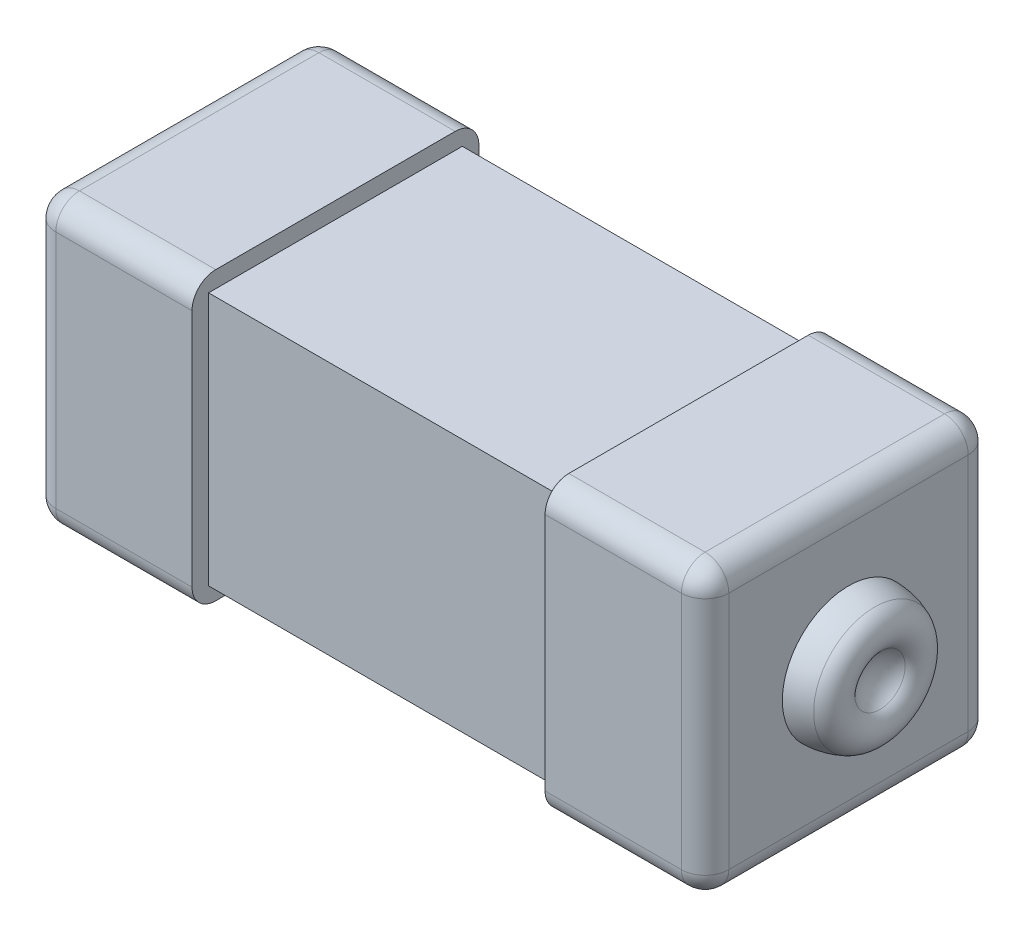
ISO-10303-21;
HEADER;
FILE_DESCRIPTION(('STEP AP214'),'2;1');
FILE_NAME('part.step','',(''),(''),'','','');
FILE_SCHEMA(('AUTOMOTIVE_DESIGN { 1 0 10303 214 1 1 1 1 }'));
ENDSEC;
DATA;
#1=APPLICATION_CONTEXT('core data for automotive mechanical design processes');
#2=APPLICATION_PROTOCOL_DEFINITION('international standard','automotive_design',2000,#1);
#3=PRODUCT_CONTEXT('',#1,'mechanical');
#4=PRODUCT('Part','Part','',(#3));
#5=PRODUCT_RELATED_PRODUCT_CATEGORY('part','',(#4));
#6=PRODUCT_DEFINITION_FORMATION('','',#4);
#7=PRODUCT_DEFINITION_CONTEXT('part definition',#1,'design');
#8=PRODUCT_DEFINITION('design','',#6,#7);
#9=PRODUCT_DEFINITION_SHAPE('','',#8);
#10=(LENGTH_UNIT() NAMED_UNIT(*) SI_UNIT(.MILLI.,.METRE.));
#11=(NAMED_UNIT(*) PLANE_ANGLE_UNIT() SI_UNIT($,.RADIAN.));
#12=(NAMED_UNIT(*) SI_UNIT($,.STERADIAN.) SOLID_ANGLE_UNIT());
#13=UNCERTAINTY_MEASURE_WITH_UNIT(LENGTH_MEASURE(1.E-05),#10,'distance_accuracy_value','');
#14=(GEOMETRIC_REPRESENTATION_CONTEXT(3) GLOBAL_UNCERTAINTY_ASSIGNED_CONTEXT((#13)) GLOBAL_UNIT_ASSIGNED_CONTEXT((#10,
#11,#12)) REPRESENTATION_CONTEXT('',''));
#15=CARTESIAN_POINT('',(0.,0.,0.));
#16=DIRECTION('',(0.,0.,1.));
#17=DIRECTION('',(1.,0.,0.));
#18=AXIS2_PLACEMENT_3D('',#15,#16,#17);
#19=CARTESIAN_POINT('',(1.6,1.15,1.15));
#20=DIRECTION('',(0.,0.,-1.));
#21=DIRECTION('',(0.,1.,0.));
#22=AXIS2_PLACEMENT_3D('',#19,#20,#21);
#23=PLANE('',#22);
#24=DIRECTION('',(0.,-1.,0.));
#25=VECTOR('',#24,1.);
#26=CARTESIAN_POINT('',(-1.6,1.15,1.15));
#27=LINE('',#26,#25);
#28=CARTESIAN_POINT('',(-1.6,1.15,1.15));
#29=VERTEX_POINT('',#28);
#30=CARTESIAN_POINT('',(-1.6,-1.15,1.15));
#31=VERTEX_POINT('',#30);
#32=EDGE_CURVE('E203',#29,#31,#27,.T.);
#33=ORIENTED_EDGE('',*,*,#32,.T.);
#34=DIRECTION('',(-1.,0.,0.));
#35=VECTOR('',#34,1.);
#36=CARTESIAN_POINT('',(1.6,-1.15,1.15));
#37=LINE('',#36,#35);
#38=CARTESIAN_POINT('',(1.6,-1.15,1.15));
#39=VERTEX_POINT('',#38);
#40=EDGE_CURVE('E225',#39,#31,#37,.T.);
#41=ORIENTED_EDGE('',*,*,#40,.F.);
#42=DIRECTION('',(0.,-1.,0.));
#43=VECTOR('',#42,1.);
#44=CARTESIAN_POINT('',(1.6,1.15,1.15));
#45=LINE('',#44,#43);
#46=CARTESIAN_POINT('',(1.6,1.15,1.15));
#47=VERTEX_POINT('',#46);
#48=EDGE_CURVE('E208',#47,#39,#45,.T.);
#49=ORIENTED_EDGE('',*,*,#48,.F.);
#50=DIRECTION('',(-1.,0.,0.));
#51=VECTOR('',#50,1.);
#52=CARTESIAN_POINT('',(1.6,1.15,1.15));
#53=LINE('',#52,#51);
#54=EDGE_CURVE('E223',#47,#29,#53,.T.);
#55=ORIENTED_EDGE('',*,*,#54,.T.);
#56=EDGE_LOOP('',(#33,#41,#49,#55));
#57=FACE_BOUND('',#56,.T.);
#58=ADVANCED_FACE('F37',(#57),#23,.F.);
#59=CARTESIAN_POINT('',(1.6,-1.15,1.15));
#60=DIRECTION('',(0.,1.,0.));
#61=DIRECTION('',(0.,0.,1.));
#62=AXIS2_PLACEMENT_3D('',#59,#60,#61);
#63=PLANE('',#62);
#64=DIRECTION('',(0.,0.,-1.));
#65=VECTOR('',#64,1.);
#66=CARTESIAN_POINT('',(-1.6,-1.15,1.15));
#67=LINE('',#66,#65);
#68=CARTESIAN_POINT('',(-1.6,-1.15,-1.15));
#69=VERTEX_POINT('',#68);
#70=EDGE_CURVE('E217',#31,#69,#67,.T.);
#71=ORIENTED_EDGE('',*,*,#70,.T.);
#72=DIRECTION('',(-1.,0.,0.));
#73=VECTOR('',#72,1.);
#74=CARTESIAN_POINT('',(1.6,-1.15,-1.15));
#75=LINE('',#74,#73);
#76=CARTESIAN_POINT('',(1.6,-1.15,-1.15));
#77=VERTEX_POINT('',#76);
#78=EDGE_CURVE('E216',#77,#69,#75,.T.);
#79=ORIENTED_EDGE('',*,*,#78,.F.);
#80=DIRECTION('',(0.,0.,-1.));
#81=VECTOR('',#80,1.);
#82=CARTESIAN_POINT('',(1.6,-1.15,1.15));
#83=LINE('',#82,#81);
#84=EDGE_CURVE('E430',#39,#77,#83,.T.);
#85=ORIENTED_EDGE('',*,*,#84,.F.);
#86=ORIENTED_EDGE('',*,*,#40,.T.);
#87=EDGE_LOOP('',(#71,#79,#85,#86));
#88=FACE_BOUND('',#87,.T.);
#89=ADVANCED_FACE('F438',(#88),#63,.F.);
#90=CARTESIAN_POINT('',(1.6,1.15,-1.15));
#91=DIRECTION('',(0.,0.,1.));
#92=DIRECTION('',(0.,-1.,0.));
#93=AXIS2_PLACEMENT_3D('',#90,#91,#92);
#94=PLANE('',#93);
#95=DIRECTION('',(0.,1.,0.));
#96=VECTOR('',#95,1.);
#97=CARTESIAN_POINT('',(-1.6,1.15,-1.15));
#98=LINE('',#97,#96);
#99=CARTESIAN_POINT('',(-1.6,1.15,-1.15));
#100=VERTEX_POINT('',#99);
#101=EDGE_CURVE('E200',#69,#100,#98,.T.);
#102=ORIENTED_EDGE('',*,*,#101,.T.);
#103=DIRECTION('',(-1.,0.,0.));
#104=VECTOR('',#103,1.);
#105=CARTESIAN_POINT('',(1.6,1.15,-1.15));
#106=LINE('',#105,#104);
#107=CARTESIAN_POINT('',(1.6,1.15,-1.15));
#108=VERTEX_POINT('',#107);
#109=EDGE_CURVE('E214',#108,#100,#106,.T.);
#110=ORIENTED_EDGE('',*,*,#109,.F.);
#111=DIRECTION('',(0.,1.,0.));
#112=VECTOR('',#111,1.);
#113=CARTESIAN_POINT('',(1.6,1.15,-1.15));
#114=LINE('',#113,#112);
#115=EDGE_CURVE('E433',#77,#108,#114,.T.);
#116=ORIENTED_EDGE('',*,*,#115,.F.);
#117=ORIENTED_EDGE('',*,*,#78,.T.);
#118=EDGE_LOOP('',(#102,#110,#116,#117));
#119=FACE_BOUND('',#118,.T.);
#120=ADVANCED_FACE('F212',(#119),#94,.F.);
#121=CARTESIAN_POINT('',(1.6,1.15,1.15));
#122=DIRECTION('',(0.,-1.,0.));
#123=DIRECTION('',(0.,0.,-1.));
#124=AXIS2_PLACEMENT_3D('',#121,#122,#123);
#125=PLANE('',#124);
#126=DIRECTION('',(0.,0.,1.));
#127=VECTOR('',#126,1.);
#128=CARTESIAN_POINT('',(-1.6,1.15,1.15));
#129=LINE('',#128,#127);
#130=EDGE_CURVE('E197',#100,#29,#129,.T.);
#131=ORIENTED_EDGE('',*,*,#130,.T.);
#132=ORIENTED_EDGE('',*,*,#54,.F.);
#133=DIRECTION('',(0.,0.,1.));
#134=VECTOR('',#133,1.);
#135=CARTESIAN_POINT('',(1.6,1.15,1.15));
#136=LINE('',#135,#134);
#137=EDGE_CURVE('E221',#108,#47,#136,.T.);
#138=ORIENTED_EDGE('',*,*,#137,.F.);
#139=ORIENTED_EDGE('',*,*,#109,.T.);
#140=EDGE_LOOP('',(#131,#132,#138,#139));
#141=FACE_BOUND('',#140,.T.);
#142=ADVANCED_FACE('F219',(#141),#125,.F.);
#143=CARTESIAN_POINT('',(1.6,1.3,1.3));
#144=DIRECTION('',(-1.,0.,0.));
#145=DIRECTION('',(0.,0.,1.));
#146=AXIS2_PLACEMENT_3D('',#143,#144,#145);
#147=PLANE('',#146);
#148=DIRECTION('',(0.,-1.,0.));
#149=VECTOR('',#148,1.);
#150=CARTESIAN_POINT('',(1.6,-1.3,1.3));
#151=LINE('',#150,#149);
#152=CARTESIAN_POINT('',(1.6,1.085,1.3));
#153=VERTEX_POINT('',#152);
#154=CARTESIAN_POINT('',(1.6,-1.085,1.3));
#155=VERTEX_POINT('',#154);
#156=EDGE_CURVE('E416',#153,#155,#151,.T.);
#157=ORIENTED_EDGE('',*,*,#156,.F.);
#158=CARTESIAN_POINT('',(1.6,1.085,1.085));
#159=DIRECTION('',(-1.,0.,0.));
#160=DIRECTION('',(0.,0.,1.));
#161=AXIS2_PLACEMENT_3D('',#158,#159,#160);
#162=CIRCLE('',#161,0.215);
#163=CARTESIAN_POINT('',(1.6,1.3,1.085));
#164=VERTEX_POINT('',#163);
#165=EDGE_CURVE('E244',#153,#164,#162,.T.);
#166=ORIENTED_EDGE('',*,*,#165,.T.);
#167=DIRECTION('',(0.,0.,1.));
#168=VECTOR('',#167,1.);
#169=CARTESIAN_POINT('',(1.6,1.3,1.3));
#170=LINE('',#169,#168);
#171=CARTESIAN_POINT('',(1.6,1.3,-1.085));
#172=VERTEX_POINT('',#171);
#173=EDGE_CURVE('E425',#172,#164,#170,.T.);
#174=ORIENTED_EDGE('',*,*,#173,.F.);
#175=CARTESIAN_POINT('',(1.6,1.085,-1.085));
#176=DIRECTION('',(-1.,0.,0.));
#177=DIRECTION('',(0.,0.,1.));
#178=AXIS2_PLACEMENT_3D('',#175,#176,#177);
#179=CIRCLE('',#178,0.215);
#180=CARTESIAN_POINT('',(1.6,1.085,-1.3));
#181=VERTEX_POINT('',#180);
#182=EDGE_CURVE('E238',#172,#181,#179,.T.);
#183=ORIENTED_EDGE('',*,*,#182,.T.);
#184=DIRECTION('',(0.,1.,0.));
#185=VECTOR('',#184,1.);
#186=CARTESIAN_POINT('',(1.6,-1.3,-1.3));
#187=LINE('',#186,#185);
#188=CARTESIAN_POINT('',(1.6,-1.085,-1.3));
#189=VERTEX_POINT('',#188);
#190=EDGE_CURVE('E422',#189,#181,#187,.T.);
#191=ORIENTED_EDGE('',*,*,#190,.F.);
#192=CARTESIAN_POINT('',(1.6,-1.085,-1.085));
#193=DIRECTION('',(-1.,0.,0.));
#194=DIRECTION('',(0.,0.,1.));
#195=AXIS2_PLACEMENT_3D('',#192,#193,#194);
#196=CIRCLE('',#195,0.215);
#197=CARTESIAN_POINT('',(1.6,-1.3,-1.085));
#198=VERTEX_POINT('',#197);
#199=EDGE_CURVE('E240',#189,#198,#196,.T.);
#200=ORIENTED_EDGE('',*,*,#199,.T.);
#201=DIRECTION('',(0.,0.,-1.));
#202=VECTOR('',#201,1.);
#203=CARTESIAN_POINT('',(1.6,-1.3,1.3));
#204=LINE('',#203,#202);
#205=CARTESIAN_POINT('',(1.6,-1.3,1.085));
#206=VERTEX_POINT('',#205);
#207=EDGE_CURVE('E419',#206,#198,#204,.T.);
#208=ORIENTED_EDGE('',*,*,#207,.F.);
#209=CARTESIAN_POINT('',(1.6,-1.085,1.085));
#210=DIRECTION('',(-1.,0.,0.));
#211=DIRECTION('',(0.,0.,1.));
#212=AXIS2_PLACEMENT_3D('',#209,#210,#211);
#213=CIRCLE('',#212,0.215);
#214=EDGE_CURVE('E242',#206,#155,#213,.T.);
#215=ORIENTED_EDGE('',*,*,#214,.T.);
#216=EDGE_LOOP('',(#157,#166,#174,#183,#191,#200,#208,#215));
#217=FACE_BOUND('',#216,.T.);
#218=ORIENTED_EDGE('',*,*,#48,.T.);
#219=ORIENTED_EDGE('',*,*,#84,.T.);
#220=ORIENTED_EDGE('',*,*,#115,.T.);
#221=ORIENTED_EDGE('',*,*,#137,.T.);
#222=EDGE_LOOP('',(#218,#219,#220,#221));
#223=FACE_BOUND('',#222,.T.);
#224=ADVANCED_FACE('F442',(#217,#223),#147,.T.);
#225=CARTESIAN_POINT('',(3.05,-1.3,1.3));
#226=DIRECTION('',(0.,0.,-1.));
#227=DIRECTION('',(-1.,0.,0.));
#228=AXIS2_PLACEMENT_3D('',#225,#226,#227);
#229=PLANE('',#228);
#230=DIRECTION('',(0.,-1.,0.));
#231=VECTOR('',#230,1.);
#232=CARTESIAN_POINT('',(2.835,-1.3,1.3));
#233=LINE('',#232,#231);
#234=CARTESIAN_POINT('',(2.835,-1.085,1.3));
#235=VERTEX_POINT('',#234);
#236=CARTESIAN_POINT('',(2.835,1.085,1.3));
#237=VERTEX_POINT('',#236);
#238=EDGE_CURVE('E233',#235,#237,#233,.F.);
#239=ORIENTED_EDGE('',*,*,#238,.T.);
#240=DIRECTION('',(-1.,0.,0.));
#241=VECTOR('',#240,1.);
#242=CARTESIAN_POINT('',(3.05,1.085,1.3));
#243=LINE('',#242,#241);
#244=EDGE_CURVE('E235',#237,#153,#243,.T.);
#245=ORIENTED_EDGE('',*,*,#244,.T.);
#246=ORIENTED_EDGE('',*,*,#156,.T.);
#247=DIRECTION('',(-1.,0.,0.));
#248=VECTOR('',#247,1.);
#249=CARTESIAN_POINT('',(3.05,-1.085,1.3));
#250=LINE('',#249,#248);
#251=EDGE_CURVE('E231',#155,#235,#250,.F.);
#252=ORIENTED_EDGE('',*,*,#251,.T.);
#253=EDGE_LOOP('',(#239,#245,#246,#252));
#254=FACE_BOUND('',#253,.T.);
#255=ADVANCED_FACE('F444',(#254),#229,.F.);
#256=CARTESIAN_POINT('',(3.05,-1.3,1.3));
#257=DIRECTION('',(0.,1.,0.));
#258=DIRECTION('',(0.,0.,1.));
#259=AXIS2_PLACEMENT_3D('',#256,#257,#258);
#260=PLANE('',#259);
#261=DIRECTION('',(0.,0.,-1.));
#262=VECTOR('',#261,1.);
#263=CARTESIAN_POINT('',(2.835,-1.3,1.3));
#264=LINE('',#263,#262);
#265=CARTESIAN_POINT('',(2.835,-1.3,-1.085));
#266=VERTEX_POINT('',#265);
#267=CARTESIAN_POINT('',(2.835,-1.3,1.085));
#268=VERTEX_POINT('',#267);
#269=EDGE_CURVE('E261',#266,#268,#264,.F.);
#270=ORIENTED_EDGE('',*,*,#269,.T.);
#271=DIRECTION('',(-1.,0.,0.));
#272=VECTOR('',#271,1.);
#273=CARTESIAN_POINT('',(3.05,-1.3,1.085));
#274=LINE('',#273,#272);
#275=EDGE_CURVE('E265',#268,#206,#274,.T.);
#276=ORIENTED_EDGE('',*,*,#275,.T.);
#277=ORIENTED_EDGE('',*,*,#207,.T.);
#278=DIRECTION('',(-1.,0.,0.));
#279=VECTOR('',#278,1.);
#280=CARTESIAN_POINT('',(3.05,-1.3,-1.085));
#281=LINE('',#280,#279);
#282=EDGE_CURVE('E263',#198,#266,#281,.F.);
#283=ORIENTED_EDGE('',*,*,#282,.T.);
#284=EDGE_LOOP('',(#270,#276,#277,#283));
#285=FACE_BOUND('',#284,.T.);
#286=ADVANCED_FACE('F451',(#285),#260,.F.);
#287=CARTESIAN_POINT('',(3.05,-1.3,-1.3));
#288=DIRECTION('',(0.,0.,1.));
#289=DIRECTION('',(1.,0.,0.));
#290=AXIS2_PLACEMENT_3D('',#287,#288,#289);
#291=PLANE('',#290);
#292=DIRECTION('',(0.,1.,0.));
#293=VECTOR('',#292,1.);
#294=CARTESIAN_POINT('',(2.835,-1.3,-1.3));
#295=LINE('',#294,#293);
#296=CARTESIAN_POINT('',(2.835,1.085,-1.3));
#297=VERTEX_POINT('',#296);
#298=CARTESIAN_POINT('',(2.835,-1.085,-1.3));
#299=VERTEX_POINT('',#298);
#300=EDGE_CURVE('E267',#297,#299,#295,.F.);
#301=ORIENTED_EDGE('',*,*,#300,.T.);
#302=DIRECTION('',(-1.,0.,0.));
#303=VECTOR('',#302,1.);
#304=CARTESIAN_POINT('',(3.05,-1.085,-1.3));
#305=LINE('',#304,#303);
#306=EDGE_CURVE('E271',#299,#189,#305,.T.);
#307=ORIENTED_EDGE('',*,*,#306,.T.);
#308=ORIENTED_EDGE('',*,*,#190,.T.);
#309=DIRECTION('',(-1.,0.,0.));
#310=VECTOR('',#309,1.);
#311=CARTESIAN_POINT('',(3.05,1.085,-1.3));
#312=LINE('',#311,#310);
#313=EDGE_CURVE('E269',#181,#297,#312,.F.);
#314=ORIENTED_EDGE('',*,*,#313,.T.);
#315=EDGE_LOOP('',(#301,#307,#308,#314));
#316=FACE_BOUND('',#315,.T.);
#317=ADVANCED_FACE('F623',(#316),#291,.F.);
#318=CARTESIAN_POINT('',(3.05,1.3,1.3));
#319=DIRECTION('',(0.,-1.,0.));
#320=DIRECTION('',(0.,0.,-1.));
#321=AXIS2_PLACEMENT_3D('',#318,#319,#320);
#322=PLANE('',#321);
#323=ORIENTED_EDGE('',*,*,#173,.T.);
#324=DIRECTION('',(-1.,0.,0.));
#325=VECTOR('',#324,1.);
#326=CARTESIAN_POINT('',(3.05,1.3,1.085));
#327=LINE('',#326,#325);
#328=CARTESIAN_POINT('',(2.835,1.3,1.085));
#329=VERTEX_POINT('',#328);
#330=EDGE_CURVE('E250',#164,#329,#327,.F.);
#331=ORIENTED_EDGE('',*,*,#330,.T.);
#332=DIRECTION('',(0.,0.,1.));
#333=VECTOR('',#332,1.);
#334=CARTESIAN_POINT('',(2.835,1.3,1.3));
#335=LINE('',#334,#333);
#336=CARTESIAN_POINT('',(2.835,1.3,-1.085));
#337=VERTEX_POINT('',#336);
#338=EDGE_CURVE('E246',#329,#337,#335,.F.);
#339=ORIENTED_EDGE('',*,*,#338,.T.);
#340=DIRECTION('',(-1.,0.,0.));
#341=VECTOR('',#340,1.);
#342=CARTESIAN_POINT('',(3.05,1.3,-1.085));
#343=LINE('',#342,#341);
#344=EDGE_CURVE('E248',#337,#172,#343,.T.);
#345=ORIENTED_EDGE('',*,*,#344,.T.);
#346=EDGE_LOOP('',(#323,#331,#339,#345));
#347=FACE_BOUND('',#346,.T.);
#348=ADVANCED_FACE('F618',(#347),#322,.F.);
#349=CARTESIAN_POINT('',(3.05,1.3,1.3));
#350=DIRECTION('',(-1.,0.,0.));
#351=DIRECTION('',(0.,0.,1.));
#352=AXIS2_PLACEMENT_3D('',#349,#350,#351);
#353=PLANE('',#352);
#354=DIRECTION('',(0.,-1.,0.));
#355=VECTOR('',#354,1.);
#356=CARTESIAN_POINT('',(3.05,1.3,1.085));
#357=LINE('',#356,#355);
#358=CARTESIAN_POINT('',(3.05,1.085,1.085));
#359=VERTEX_POINT('',#358);
#360=CARTESIAN_POINT('',(3.05,-1.085,1.085));
#361=VERTEX_POINT('',#360);
#362=EDGE_CURVE('E256',#359,#361,#357,.T.);
#363=ORIENTED_EDGE('',*,*,#362,.T.);
#364=DIRECTION('',(0.,0.,-1.));
#365=VECTOR('',#364,1.);
#366=CARTESIAN_POINT('',(3.05,-1.085,1.3));
#367=LINE('',#366,#365);
#368=CARTESIAN_POINT('',(3.05,-1.085,-1.085));
#369=VERTEX_POINT('',#368);
#370=EDGE_CURVE('E259',#361,#369,#367,.T.);
#371=ORIENTED_EDGE('',*,*,#370,.T.);
#372=DIRECTION('',(0.,1.,0.));
#373=VECTOR('',#372,1.);
#374=CARTESIAN_POINT('',(3.05,1.3,-1.085));
#375=LINE('',#374,#373);
#376=CARTESIAN_POINT('',(3.05,1.085,-1.085));
#377=VERTEX_POINT('',#376);
#378=EDGE_CURVE('E254',#369,#377,#375,.T.);
#379=ORIENTED_EDGE('',*,*,#378,.T.);
#380=DIRECTION('',(0.,0.,1.));
#381=VECTOR('',#380,1.);
#382=CARTESIAN_POINT('',(3.05,1.085,1.3));
#383=LINE('',#382,#381);
#384=EDGE_CURVE('E252',#377,#359,#383,.T.);
#385=ORIENTED_EDGE('',*,*,#384,.T.);
#386=EDGE_LOOP('',(#363,#371,#379,#385));
#387=FACE_BOUND('',#386,.T.);
#388=CARTESIAN_POINT('',(3.05,0.,0.));
#389=DIRECTION('',(1.,0.,0.));
#390=DIRECTION('',(0.,0.,-1.));
#391=AXIS2_PLACEMENT_3D('',#388,#389,#390);
#392=CIRCLE('',#391,0.6);
#393=CARTESIAN_POINT('',(3.05,0.,-0.6));
#394=VERTEX_POINT('',#393);
#395=EDGE_CURVE('E310',#394,#394,#392,.T.);
#396=ORIENTED_EDGE('',*,*,#395,.F.);
#397=EDGE_LOOP('',(#396));
#398=FACE_BOUND('',#397,.T.);
#399=ADVANCED_FACE('F615',(#387,#398),#353,.F.);
#400=CARTESIAN_POINT('',(3.53,0.,0.));
#401=DIRECTION('',(1.,0.,0.));
#402=DIRECTION('',(0.,0.,-1.));
#403=AXIS2_PLACEMENT_3D('',#400,#401,#402);
#404=SPHERICAL_SURFACE('',#403,0.3);
#405=CARTESIAN_POINT('',(3.33514208389716,0.,0.));
#406=DIRECTION('',(1.,0.,0.));
#407=DIRECTION('',(0.,0.,-1.));
#408=AXIS2_PLACEMENT_3D('',#405,#406,#407);
#409=CIRCLE('',#408,0.228101715320288);
#410=CARTESIAN_POINT('',(3.33514208389716,0.,-0.228101715320288));
#411=VERTEX_POINT('',#410);
#412=EDGE_CURVE('E413',#411,#411,#409,.T.);
#413=ORIENTED_EDGE('',*,*,#412,.T.);
#414=EDGE_LOOP('',(#413));
#415=FACE_BOUND('',#414,.T.);
#416=ADVANCED_FACE('F612',(#415),#404,.F.);
#417=CARTESIAN_POINT('',(3.21,0.,0.));
#418=DIRECTION('',(1.,0.,0.));
#419=DIRECTION('',(0.,0.,-1.));
#420=AXIS2_PLACEMENT_3D('',#417,#418,#419);
#421=TOROIDAL_SURFACE('',#420,0.374593705825985,0.192666666666667);
#422=CARTESIAN_POINT('',(3.28567921440262,0.,0.));
#423=DIRECTION('',(1.,0.,0.));
#424=DIRECTION('',(0.,0.,-1.));
#425=AXIS2_PLACEMENT_3D('',#422,#423,#424);
#426=CIRCLE('',#425,0.551774689432711);
#427=CARTESIAN_POINT('',(3.28567921440262,0.,-0.551774689432711));
#428=VERTEX_POINT('',#427);
#429=EDGE_CURVE('E410',#428,#428,#426,.T.);
#430=ORIENTED_EDGE('',*,*,#429,.T.);
#431=EDGE_LOOP('',(#430));
#432=FACE_BOUND('',#431,.T.);
#433=ORIENTED_EDGE('',*,*,#412,.F.);
#434=EDGE_LOOP('',(#433));
#435=FACE_BOUND('',#434,.T.);
#436=ADVANCED_FACE('F608',(#432,#435),#421,.T.);
#437=CARTESIAN_POINT('',(3.05,0.,0.));
#438=DIRECTION('',(1.,0.,0.));
#439=DIRECTION('',(0.,0.,-1.));
#440=AXIS2_PLACEMENT_3D('',#437,#438,#439);
#441=SPHERICAL_SURFACE('',#440,0.6);
#442=ORIENTED_EDGE('',*,*,#395,.T.);
#443=EDGE_LOOP('',(#442));
#444=FACE_BOUND('',#443,.T.);
#445=ORIENTED_EDGE('',*,*,#429,.F.);
#446=EDGE_LOOP('',(#445));
#447=FACE_BOUND('',#446,.T.);
#448=ADVANCED_FACE('F513',(#444,#447),#441,.T.);
#449=CARTESIAN_POINT('',(3.05,-1.085,-1.085));
#450=DIRECTION('',(-1.,0.,0.));
#451=DIRECTION('',(0.,0.,1.));
#452=AXIS2_PLACEMENT_3D('',#449,#450,#451);
#453=CYLINDRICAL_SURFACE('',#452,0.215);
#454=CARTESIAN_POINT('',(2.835,-1.085,-1.085));
#455=DIRECTION('',(1.,0.,0.));
#456=DIRECTION('',(0.,0.,-1.));
#457=AXIS2_PLACEMENT_3D('',#454,#455,#456);
#458=CIRCLE('',#457,0.215);
#459=EDGE_CURVE('E307',#266,#299,#458,.T.);
#460=ORIENTED_EDGE('',*,*,#459,.F.);
#461=ORIENTED_EDGE('',*,*,#282,.F.);
#462=ORIENTED_EDGE('',*,*,#199,.F.);
#463=ORIENTED_EDGE('',*,*,#306,.F.);
#464=EDGE_LOOP('',(#460,#461,#462,#463));
#465=FACE_BOUND('',#464,.T.);
#466=ADVANCED_FACE('F509',(#465),#453,.T.);
#467=CARTESIAN_POINT('',(2.835,-1.085,-1.085));
#468=DIRECTION('',(0.,0.,1.));
#469=DIRECTION('',(1.,0.,0.));
#470=AXIS2_PLACEMENT_3D('',#467,#468,#469);
#471=SPHERICAL_SURFACE('',#470,0.215);
#472=CARTESIAN_POINT('',(2.835,-1.085,-1.085));
#473=DIRECTION('',(0.,0.,-1.));
#474=DIRECTION('',(-1.,0.,0.));
#475=AXIS2_PLACEMENT_3D('',#472,#473,#474);
#476=CIRCLE('',#475,0.215);
#477=EDGE_CURVE('E301',#266,#369,#476,.F.);
#478=ORIENTED_EDGE('',*,*,#477,.F.);
#479=ORIENTED_EDGE('',*,*,#459,.T.);
#480=CARTESIAN_POINT('',(2.835,-1.085,-1.085));
#481=DIRECTION('',(0.,-1.,0.));
#482=DIRECTION('',(0.,0.,-1.));
#483=AXIS2_PLACEMENT_3D('',#480,#481,#482);
#484=CIRCLE('',#483,0.215);
#485=EDGE_CURVE('E304',#369,#299,#484,.F.);
#486=ORIENTED_EDGE('',*,*,#485,.F.);
#487=EDGE_LOOP('',(#478,#479,#486));
#488=FACE_BOUND('',#487,.T.);
#489=ADVANCED_FACE('F505',(#488),#471,.T.);
#490=CARTESIAN_POINT('',(3.05,1.085,-1.085));
#491=DIRECTION('',(-1.,0.,0.));
#492=DIRECTION('',(0.,0.,1.));
#493=AXIS2_PLACEMENT_3D('',#490,#491,#492);
#494=CYLINDRICAL_SURFACE('',#493,0.215);
#495=ORIENTED_EDGE('',*,*,#182,.F.);
#496=ORIENTED_EDGE('',*,*,#344,.F.);
#497=CARTESIAN_POINT('',(2.835,1.085,-1.085));
#498=DIRECTION('',(1.,0.,0.));
#499=DIRECTION('',(0.,0.,-1.));
#500=AXIS2_PLACEMENT_3D('',#497,#498,#499);
#501=CIRCLE('',#500,0.215);
#502=EDGE_CURVE('E298',#297,#337,#501,.T.);
#503=ORIENTED_EDGE('',*,*,#502,.F.);
#504=ORIENTED_EDGE('',*,*,#313,.F.);
#505=EDGE_LOOP('',(#495,#496,#503,#504));
#506=FACE_BOUND('',#505,.T.);
#507=ADVANCED_FACE('F501',(#506),#494,.T.);
#508=CARTESIAN_POINT('',(2.835,1.3,-1.085));
#509=DIRECTION('',(0.,1.,0.));
#510=DIRECTION('',(0.,0.,1.));
#511=AXIS2_PLACEMENT_3D('',#508,#509,#510);
#512=CYLINDRICAL_SURFACE('',#511,0.215);
#513=ORIENTED_EDGE('',*,*,#485,.T.);
#514=ORIENTED_EDGE('',*,*,#300,.F.);
#515=CARTESIAN_POINT('',(2.835,1.085,-1.085));
#516=DIRECTION('',(0.,1.,0.));
#517=DIRECTION('',(0.,0.,1.));
#518=AXIS2_PLACEMENT_3D('',#515,#516,#517);
#519=CIRCLE('',#518,0.215);
#520=EDGE_CURVE('E295',#377,#297,#519,.T.);
#521=ORIENTED_EDGE('',*,*,#520,.F.);
#522=ORIENTED_EDGE('',*,*,#378,.F.);
#523=EDGE_LOOP('',(#513,#514,#521,#522));
#524=FACE_BOUND('',#523,.T.);
#525=ADVANCED_FACE('F497',(#524),#512,.T.);
#526=CARTESIAN_POINT('',(2.835,-1.085,1.3));
#527=DIRECTION('',(0.,0.,-1.));
#528=DIRECTION('',(-1.,0.,0.));
#529=AXIS2_PLACEMENT_3D('',#526,#527,#528);
#530=CYLINDRICAL_SURFACE('',#529,0.215);
#531=ORIENTED_EDGE('',*,*,#477,.T.);
#532=ORIENTED_EDGE('',*,*,#370,.F.);
#533=CARTESIAN_POINT('',(2.835,-1.085,1.085));
#534=DIRECTION('',(0.,0.,1.));
#535=DIRECTION('',(1.,0.,0.));
#536=AXIS2_PLACEMENT_3D('',#533,#534,#535);
#537=CIRCLE('',#536,0.215);
#538=EDGE_CURVE('E292',#268,#361,#537,.T.);
#539=ORIENTED_EDGE('',*,*,#538,.F.);
#540=ORIENTED_EDGE('',*,*,#269,.F.);
#541=EDGE_LOOP('',(#531,#532,#539,#540));
#542=FACE_BOUND('',#541,.T.);
#543=ADVANCED_FACE('F493',(#542),#530,.T.);
#544=CARTESIAN_POINT('',(3.05,-1.085,1.085));
#545=DIRECTION('',(-1.,0.,0.));
#546=DIRECTION('',(0.,0.,1.));
#547=AXIS2_PLACEMENT_3D('',#544,#545,#546);
#548=CYLINDRICAL_SURFACE('',#547,0.215);
#549=ORIENTED_EDGE('',*,*,#214,.F.);
#550=ORIENTED_EDGE('',*,*,#275,.F.);
#551=CARTESIAN_POINT('',(2.835,-1.085,1.085));
#552=DIRECTION('',(1.,0.,0.));
#553=DIRECTION('',(0.,0.,-1.));
#554=AXIS2_PLACEMENT_3D('',#551,#552,#553);
#555=CIRCLE('',#554,0.215);
#556=EDGE_CURVE('E289',#235,#268,#555,.T.);
#557=ORIENTED_EDGE('',*,*,#556,.F.);
#558=ORIENTED_EDGE('',*,*,#251,.F.);
#559=EDGE_LOOP('',(#549,#550,#557,#558));
#560=FACE_BOUND('',#559,.T.);
#561=ADVANCED_FACE('F489',(#560),#548,.T.);
#562=CARTESIAN_POINT('',(2.835,1.085,-1.085));
#563=DIRECTION('',(0.,0.,1.));
#564=DIRECTION('',(1.,0.,0.));
#565=AXIS2_PLACEMENT_3D('',#562,#563,#564);
#566=SPHERICAL_SURFACE('',#565,0.215);
#567=ORIENTED_EDGE('',*,*,#520,.T.);
#568=ORIENTED_EDGE('',*,*,#502,.T.);
#569=CARTESIAN_POINT('',(2.835,1.085,-1.085));
#570=DIRECTION('',(0.,0.,-1.));
#571=DIRECTION('',(-1.,0.,0.));
#572=AXIS2_PLACEMENT_3D('',#569,#570,#571);
#573=CIRCLE('',#572,0.215);
#574=EDGE_CURVE('E286',#377,#337,#573,.F.);
#575=ORIENTED_EDGE('',*,*,#574,.F.);
#576=EDGE_LOOP('',(#567,#568,#575));
#577=FACE_BOUND('',#576,.T.);
#578=ADVANCED_FACE('F485',(#577),#566,.T.);
#579=CARTESIAN_POINT('',(2.835,-1.085,1.085));
#580=DIRECTION('',(0.,0.,1.));
#581=DIRECTION('',(1.,0.,0.));
#582=AXIS2_PLACEMENT_3D('',#579,#580,#581);
#583=SPHERICAL_SURFACE('',#582,0.215);
#584=ORIENTED_EDGE('',*,*,#556,.T.);
#585=ORIENTED_EDGE('',*,*,#538,.T.);
#586=CARTESIAN_POINT('',(2.835,-1.085,1.085));
#587=DIRECTION('',(0.,-1.,0.));
#588=DIRECTION('',(0.,0.,-1.));
#589=AXIS2_PLACEMENT_3D('',#586,#587,#588);
#590=CIRCLE('',#589,0.215);
#591=EDGE_CURVE('E284',#235,#361,#590,.F.);
#592=ORIENTED_EDGE('',*,*,#591,.F.);
#593=EDGE_LOOP('',(#584,#585,#592));
#594=FACE_BOUND('',#593,.T.);
#595=ADVANCED_FACE('F481',(#594),#583,.T.);
#596=CARTESIAN_POINT('',(2.835,1.085,1.3));
#597=DIRECTION('',(0.,0.,1.));
#598=DIRECTION('',(1.,0.,0.));
#599=AXIS2_PLACEMENT_3D('',#596,#597,#598);
#600=CYLINDRICAL_SURFACE('',#599,0.215);
#601=ORIENTED_EDGE('',*,*,#574,.T.);
#602=ORIENTED_EDGE('',*,*,#338,.F.);
#603=CARTESIAN_POINT('',(2.835,1.085,1.085));
#604=DIRECTION('',(0.,0.,1.));
#605=DIRECTION('',(1.,0.,0.));
#606=AXIS2_PLACEMENT_3D('',#603,#604,#605);
#607=CIRCLE('',#606,0.215);
#608=EDGE_CURVE('E281',#359,#329,#607,.T.);
#609=ORIENTED_EDGE('',*,*,#608,.F.);
#610=ORIENTED_EDGE('',*,*,#384,.F.);
#611=EDGE_LOOP('',(#601,#602,#609,#610));
#612=FACE_BOUND('',#611,.T.);
#613=ADVANCED_FACE('F477',(#612),#600,.T.);
#614=CARTESIAN_POINT('',(2.835,1.3,1.085));
#615=DIRECTION('',(0.,-1.,0.));
#616=DIRECTION('',(0.,0.,-1.));
#617=AXIS2_PLACEMENT_3D('',#614,#615,#616);
#618=CYLINDRICAL_SURFACE('',#617,0.215);
#619=ORIENTED_EDGE('',*,*,#591,.T.);
#620=ORIENTED_EDGE('',*,*,#362,.F.);
#621=CARTESIAN_POINT('',(2.835,1.085,1.085));
#622=DIRECTION('',(0.,1.,0.));
#623=DIRECTION('',(0.,0.,1.));
#624=AXIS2_PLACEMENT_3D('',#621,#622,#623);
#625=CIRCLE('',#624,0.215);
#626=EDGE_CURVE('E277',#237,#359,#625,.T.);
#627=ORIENTED_EDGE('',*,*,#626,.F.);
#628=ORIENTED_EDGE('',*,*,#238,.F.);
#629=EDGE_LOOP('',(#619,#620,#627,#628));
#630=FACE_BOUND('',#629,.T.);
#631=ADVANCED_FACE('F473',(#630),#618,.T.);
#632=CARTESIAN_POINT('',(2.835,1.085,1.085));
#633=DIRECTION('',(0.,0.,1.));
#634=DIRECTION('',(1.,0.,0.));
#635=AXIS2_PLACEMENT_3D('',#632,#633,#634);
#636=SPHERICAL_SURFACE('',#635,0.215);
#637=ORIENTED_EDGE('',*,*,#626,.T.);
#638=ORIENTED_EDGE('',*,*,#608,.T.);
#639=CARTESIAN_POINT('',(2.835,1.085,1.085));
#640=DIRECTION('',(1.,0.,0.));
#641=DIRECTION('',(0.,0.,-1.));
#642=AXIS2_PLACEMENT_3D('',#639,#640,#641);
#643=CIRCLE('',#642,0.215);
#644=EDGE_CURVE('E274',#237,#329,#643,.F.);
#645=ORIENTED_EDGE('',*,*,#644,.F.);
#646=EDGE_LOOP('',(#637,#638,#645));
#647=FACE_BOUND('',#646,.T.);
#648=ADVANCED_FACE('F469',(#647),#636,.T.);
#649=CARTESIAN_POINT('',(3.05,1.085,1.085));
#650=DIRECTION('',(-1.,0.,0.));
#651=DIRECTION('',(0.,0.,1.));
#652=AXIS2_PLACEMENT_3D('',#649,#650,#651);
#653=CYLINDRICAL_SURFACE('',#652,0.215);
#654=ORIENTED_EDGE('',*,*,#644,.T.);
#655=ORIENTED_EDGE('',*,*,#330,.F.);
#656=ORIENTED_EDGE('',*,*,#165,.F.);
#657=ORIENTED_EDGE('',*,*,#244,.F.);
#658=EDGE_LOOP('',(#654,#655,#656,#657));
#659=FACE_BOUND('',#658,.T.);
#660=ADVANCED_FACE('F466',(#659),#653,.T.);
#661=CARTESIAN_POINT('',(-1.6,1.3,1.3));
#662=DIRECTION('',(1.,0.,0.));
#663=DIRECTION('',(0.,0.,1.));
#664=AXIS2_PLACEMENT_3D('',#661,#662,#663);
#665=PLANE('',#664);
#666=DIRECTION('',(0.,0.,1.));
#667=VECTOR('',#666,1.);
#668=CARTESIAN_POINT('',(-1.6,1.3,1.3));
#669=LINE('',#668,#667);
#670=CARTESIAN_POINT('',(-1.6,1.3,-1.085));
#671=VERTEX_POINT('',#670);
#672=CARTESIAN_POINT('',(-1.6,1.3,1.085));
#673=VERTEX_POINT('',#672);
#674=EDGE_CURVE('E400',#671,#673,#669,.T.);
#675=ORIENTED_EDGE('',*,*,#674,.T.);
#676=CARTESIAN_POINT('',(-1.6,1.085,1.085));
#677=DIRECTION('',(1.,0.,0.));
#678=DIRECTION('',(0.,0.,-1.));
#679=AXIS2_PLACEMENT_3D('',#676,#677,#678);
#680=CIRCLE('',#679,0.215);
#681=CARTESIAN_POINT('',(-1.6,1.085,1.3));
#682=VERTEX_POINT('',#681);
#683=EDGE_CURVE('E323',#673,#682,#680,.T.);
#684=ORIENTED_EDGE('',*,*,#683,.T.);
#685=DIRECTION('',(0.,-1.,0.));
#686=VECTOR('',#685,1.);
#687=CARTESIAN_POINT('',(-1.6,-1.3,1.3));
#688=LINE('',#687,#686);
#689=CARTESIAN_POINT('',(-1.6,-1.085,1.3));
#690=VERTEX_POINT('',#689);
#691=EDGE_CURVE('E397',#682,#690,#688,.T.);
#692=ORIENTED_EDGE('',*,*,#691,.T.);
#693=CARTESIAN_POINT('',(-1.6,-1.085,1.085));
#694=DIRECTION('',(1.,0.,0.));
#695=DIRECTION('',(0.,0.,-1.));
#696=AXIS2_PLACEMENT_3D('',#693,#694,#695);
#697=CIRCLE('',#696,0.215);
#698=CARTESIAN_POINT('',(-1.6,-1.3,1.085));
#699=VERTEX_POINT('',#698);
#700=EDGE_CURVE('E321',#690,#699,#697,.T.);
#701=ORIENTED_EDGE('',*,*,#700,.T.);
#702=DIRECTION('',(0.,0.,-1.));
#703=VECTOR('',#702,1.);
#704=CARTESIAN_POINT('',(-1.6,-1.3,1.3));
#705=LINE('',#704,#703);
#706=CARTESIAN_POINT('',(-1.6,-1.3,-1.085));
#707=VERTEX_POINT('',#706);
#708=EDGE_CURVE('E278',#699,#707,#705,.T.);
#709=ORIENTED_EDGE('',*,*,#708,.T.);
#710=CARTESIAN_POINT('',(-1.6,-1.085,-1.085));
#711=DIRECTION('',(1.,0.,0.));
#712=DIRECTION('',(0.,0.,-1.));
#713=AXIS2_PLACEMENT_3D('',#710,#711,#712);
#714=CIRCLE('',#713,0.215);
#715=CARTESIAN_POINT('',(-1.6,-1.085,-1.3));
#716=VERTEX_POINT('',#715);
#717=EDGE_CURVE('E319',#707,#716,#714,.T.);
#718=ORIENTED_EDGE('',*,*,#717,.T.);
#719=DIRECTION('',(0.,1.,0.));
#720=VECTOR('',#719,1.);
#721=CARTESIAN_POINT('',(-1.6,-1.3,-1.3));
#722=LINE('',#721,#720);
#723=CARTESIAN_POINT('',(-1.6,1.085,-1.3));
#724=VERTEX_POINT('',#723);
#725=EDGE_CURVE('E403',#716,#724,#722,.T.);
#726=ORIENTED_EDGE('',*,*,#725,.T.);
#727=CARTESIAN_POINT('',(-1.6,1.085,-1.085));
#728=DIRECTION('',(1.,0.,0.));
#729=DIRECTION('',(0.,0.,-1.));
#730=AXIS2_PLACEMENT_3D('',#727,#728,#729);
#731=CIRCLE('',#730,0.215);
#732=EDGE_CURVE('E317',#724,#671,#731,.T.);
#733=ORIENTED_EDGE('',*,*,#732,.T.);
#734=EDGE_LOOP('',(#675,#684,#692,#701,#709,#718,#726,#733));
#735=FACE_BOUND('',#734,.T.);
#736=ORIENTED_EDGE('',*,*,#32,.F.);
#737=ORIENTED_EDGE('',*,*,#130,.F.);
#738=ORIENTED_EDGE('',*,*,#101,.F.);
#739=ORIENTED_EDGE('',*,*,#70,.F.);
#740=EDGE_LOOP('',(#736,#737,#738,#739));
#741=FACE_BOUND('',#740,.T.);
#742=ADVANCED_FACE('F199',(#735,#741),#665,.T.);
#743=CARTESIAN_POINT('',(-3.05,-1.3,1.3));
#744=DIRECTION('',(0.,0.,1.));
#745=DIRECTION('',(1.,0.,0.));
#746=AXIS2_PLACEMENT_3D('',#743,#744,#745);
#747=PLANE('',#746);
#748=ORIENTED_EDGE('',*,*,#691,.F.);
#749=DIRECTION('',(1.,0.,0.));
#750=VECTOR('',#749,1.);
#751=CARTESIAN_POINT('',(-3.05,1.085,1.3));
#752=LINE('',#751,#750);
#753=CARTESIAN_POINT('',(-2.835,1.085,1.3));
#754=VERTEX_POINT('',#753);
#755=EDGE_CURVE('E329',#682,#754,#752,.F.);
#756=ORIENTED_EDGE('',*,*,#755,.T.);
#757=DIRECTION('',(0.,-1.,0.));
#758=VECTOR('',#757,1.);
#759=CARTESIAN_POINT('',(-2.835,-1.3,1.3));
#760=LINE('',#759,#758);
#761=CARTESIAN_POINT('',(-2.835,-1.085,1.3));
#762=VERTEX_POINT('',#761);
#763=EDGE_CURVE('E327',#754,#762,#760,.T.);
#764=ORIENTED_EDGE('',*,*,#763,.T.);
#765=DIRECTION('',(1.,0.,0.));
#766=VECTOR('',#765,1.);
#767=CARTESIAN_POINT('',(-3.05,-1.085,1.3));
#768=LINE('',#767,#766);
#769=EDGE_CURVE('E325',#762,#690,#768,.T.);
#770=ORIENTED_EDGE('',*,*,#769,.T.);
#771=EDGE_LOOP('',(#748,#756,#764,#770));
#772=FACE_BOUND('',#771,.T.);
#773=ADVANCED_FACE('F595',(#772),#747,.T.);
#774=CARTESIAN_POINT('',(-3.05,1.3,1.3));
#775=DIRECTION('',(0.,1.,0.));
#776=DIRECTION('',(0.,0.,1.));
#777=AXIS2_PLACEMENT_3D('',#774,#775,#776);
#778=PLANE('',#777);
#779=DIRECTION('',(0.,0.,1.));
#780=VECTOR('',#779,1.);
#781=CARTESIAN_POINT('',(-2.835,1.3,1.3));
#782=LINE('',#781,#780);
#783=CARTESIAN_POINT('',(-2.835,1.3,-1.085));
#784=VERTEX_POINT('',#783);
#785=CARTESIAN_POINT('',(-2.835,1.3,1.085));
#786=VERTEX_POINT('',#785);
#787=EDGE_CURVE('E273',#784,#786,#782,.T.);
#788=ORIENTED_EDGE('',*,*,#787,.T.);
#789=DIRECTION('',(1.,0.,0.));
#790=VECTOR('',#789,1.);
#791=CARTESIAN_POINT('',(-3.05,1.3,1.085));
#792=LINE('',#791,#790);
#793=EDGE_CURVE('E314',#786,#673,#792,.T.);
#794=ORIENTED_EDGE('',*,*,#793,.T.);
#795=ORIENTED_EDGE('',*,*,#674,.F.);
#796=DIRECTION('',(1.,0.,0.));
#797=VECTOR('',#796,1.);
#798=CARTESIAN_POINT('',(-3.05,1.3,-1.085));
#799=LINE('',#798,#797);
#800=EDGE_CURVE('E312',#671,#784,#799,.F.);
#801=ORIENTED_EDGE('',*,*,#800,.T.);
#802=EDGE_LOOP('',(#788,#794,#795,#801));
#803=FACE_BOUND('',#802,.T.);
#804=ADVANCED_FACE('F590',(#803),#778,.T.);
#805=CARTESIAN_POINT('',(-3.05,-1.3,-1.3));
#806=DIRECTION('',(0.,0.,-1.));
#807=DIRECTION('',(-1.,0.,0.));
#808=AXIS2_PLACEMENT_3D('',#805,#806,#807);
#809=PLANE('',#808);
#810=ORIENTED_EDGE('',*,*,#725,.F.);
#811=DIRECTION('',(1.,0.,0.));
#812=VECTOR('',#811,1.);
#813=CARTESIAN_POINT('',(-3.05,-1.085,-1.3));
#814=LINE('',#813,#812);
#815=CARTESIAN_POINT('',(-2.835,-1.085,-1.3));
#816=VERTEX_POINT('',#815);
#817=EDGE_CURVE('E11',#716,#816,#814,.F.);
#818=ORIENTED_EDGE('',*,*,#817,.T.);
#819=DIRECTION('',(0.,1.,0.));
#820=VECTOR('',#819,1.);
#821=CARTESIAN_POINT('',(-2.835,1.3,-1.3));
#822=LINE('',#821,#820);
#823=CARTESIAN_POINT('',(-2.835,1.085,-1.3));
#824=VERTEX_POINT('',#823);
#825=EDGE_CURVE('E53',#816,#824,#822,.T.);
#826=ORIENTED_EDGE('',*,*,#825,.T.);
#827=DIRECTION('',(1.,0.,0.));
#828=VECTOR('',#827,1.);
#829=CARTESIAN_POINT('',(-3.05,1.085,-1.3));
#830=LINE('',#829,#828);
#831=EDGE_CURVE('E46',#824,#724,#830,.T.);
#832=ORIENTED_EDGE('',*,*,#831,.T.);
#833=EDGE_LOOP('',(#810,#818,#826,#832));
#834=FACE_BOUND('',#833,.T.);
#835=ADVANCED_FACE('F567',(#834),#809,.T.);
#836=CARTESIAN_POINT('',(-3.05,-1.3,1.3));
#837=DIRECTION('',(0.,-1.,0.));
#838=DIRECTION('',(0.,0.,-1.));
#839=AXIS2_PLACEMENT_3D('',#836,#837,#838);
#840=PLANE('',#839);
#841=ORIENTED_EDGE('',*,*,#708,.F.);
#842=DIRECTION('',(1.,0.,0.));
#843=VECTOR('',#842,1.);
#844=CARTESIAN_POINT('',(-3.05,-1.3,1.085));
#845=LINE('',#844,#843);
#846=CARTESIAN_POINT('',(-2.835,-1.3,1.085));
#847=VERTEX_POINT('',#846);
#848=EDGE_CURVE('E344',#699,#847,#845,.F.);
#849=ORIENTED_EDGE('',*,*,#848,.T.);
#850=DIRECTION('',(0.,0.,-1.));
#851=VECTOR('',#850,1.);
#852=CARTESIAN_POINT('',(-2.835,-1.3,-1.3));
#853=LINE('',#852,#851);
#854=CARTESIAN_POINT('',(-2.835,-1.3,-1.085));
#855=VERTEX_POINT('',#854);
#856=EDGE_CURVE('E340',#847,#855,#853,.T.);
#857=ORIENTED_EDGE('',*,*,#856,.T.);
#858=DIRECTION('',(1.,0.,0.));
#859=VECTOR('',#858,1.);
#860=CARTESIAN_POINT('',(-3.05,-1.3,-1.085));
#861=LINE('',#860,#859);
#862=EDGE_CURVE('E342',#855,#707,#861,.T.);
#863=ORIENTED_EDGE('',*,*,#862,.T.);
#864=EDGE_LOOP('',(#841,#849,#857,#863));
#865=FACE_BOUND('',#864,.T.);
#866=ADVANCED_FACE('F574',(#865),#840,.T.);
#867=CARTESIAN_POINT('',(-3.05,1.3,1.3));
#868=DIRECTION('',(1.,0.,0.));
#869=DIRECTION('',(0.,0.,1.));
#870=AXIS2_PLACEMENT_3D('',#867,#868,#869);
#871=PLANE('',#870);
#872=DIRECTION('',(0.,1.,0.));
#873=VECTOR('',#872,1.);
#874=CARTESIAN_POINT('',(-3.05,-1.3,-1.085));
#875=LINE('',#874,#873);
#876=CARTESIAN_POINT('',(-3.05,1.085,-1.085));
#877=VERTEX_POINT('',#876);
#878=CARTESIAN_POINT('',(-3.05,-1.085,-1.085));
#879=VERTEX_POINT('',#878);
#880=EDGE_CURVE('E333',#877,#879,#875,.F.);
#881=ORIENTED_EDGE('',*,*,#880,.T.);
#882=DIRECTION('',(0.,0.,-1.));
#883=VECTOR('',#882,1.);
#884=CARTESIAN_POINT('',(-3.05,-1.085,1.3));
#885=LINE('',#884,#883);
#886=CARTESIAN_POINT('',(-3.05,-1.085,1.085));
#887=VERTEX_POINT('',#886);
#888=EDGE_CURVE('E338',#879,#887,#885,.F.);
#889=ORIENTED_EDGE('',*,*,#888,.T.);
#890=DIRECTION('',(0.,-1.,0.));
#891=VECTOR('',#890,1.);
#892=CARTESIAN_POINT('',(-3.05,1.3,1.085));
#893=LINE('',#892,#891);
#894=CARTESIAN_POINT('',(-3.05,1.085,1.085));
#895=VERTEX_POINT('',#894);
#896=EDGE_CURVE('E335',#887,#895,#893,.F.);
#897=ORIENTED_EDGE('',*,*,#896,.T.);
#898=DIRECTION('',(0.,0.,1.));
#899=VECTOR('',#898,1.);
#900=CARTESIAN_POINT('',(-3.05,1.085,-1.3));
#901=LINE('',#900,#899);
#902=EDGE_CURVE('E331',#895,#877,#901,.F.);
#903=ORIENTED_EDGE('',*,*,#902,.T.);
#904=EDGE_LOOP('',(#881,#889,#897,#903));
#905=FACE_BOUND('',#904,.T.);
#906=CARTESIAN_POINT('',(-3.05,0.,0.));
#907=DIRECTION('',(1.,0.,0.));
#908=DIRECTION('',(0.,0.,-1.));
#909=AXIS2_PLACEMENT_3D('',#906,#907,#908);
#910=CIRCLE('',#909,0.6);
#911=CARTESIAN_POINT('',(-3.05,0.,-0.6));
#912=VERTEX_POINT('',#911);
#913=EDGE_CURVE('E383',#912,#912,#910,.T.);
#914=ORIENTED_EDGE('',*,*,#913,.T.);
#915=EDGE_LOOP('',(#914));
#916=FACE_BOUND('',#915,.T.);
#917=ADVANCED_FACE('F586',(#905,#916),#871,.F.);
#918=CARTESIAN_POINT('',(-3.53,0.,0.));
#919=DIRECTION('',(-1.,0.,0.));
#920=DIRECTION('',(0.,0.,-1.));
#921=AXIS2_PLACEMENT_3D('',#918,#919,#920);
#922=SPHERICAL_SURFACE('',#921,0.3);
#923=CARTESIAN_POINT('',(-3.33514208389716,0.,0.));
#924=DIRECTION('',(1.,0.,0.));
#925=DIRECTION('',(0.,0.,-1.));
#926=AXIS2_PLACEMENT_3D('',#923,#924,#925);
#927=CIRCLE('',#926,0.228101715320288);
#928=CARTESIAN_POINT('',(-3.33514208389716,0.,-0.228101715320288));
#929=VERTEX_POINT('',#928);
#930=EDGE_CURVE('E392',#929,#929,#927,.T.);
#931=ORIENTED_EDGE('',*,*,#930,.F.);
#932=EDGE_LOOP('',(#931));
#933=FACE_BOUND('',#932,.T.);
#934=ADVANCED_FACE('F815',(#933),#922,.F.);
#935=CARTESIAN_POINT('',(-3.21,0.,0.));
#936=DIRECTION('',(-1.,0.,0.));
#937=DIRECTION('',(0.,0.,-1.));
#938=AXIS2_PLACEMENT_3D('',#935,#936,#937);
#939=TOROIDAL_SURFACE('',#938,0.374593705825985,0.192666666666667);
#940=CARTESIAN_POINT('',(-3.28567921440262,0.,0.));
#941=DIRECTION('',(1.,0.,0.));
#942=DIRECTION('',(0.,0.,-1.));
#943=AXIS2_PLACEMENT_3D('',#940,#941,#942);
#944=CIRCLE('',#943,0.551774689432711);
#945=CARTESIAN_POINT('',(-3.28567921440262,0.,-0.551774689432711));
#946=VERTEX_POINT('',#945);
#947=EDGE_CURVE('E387',#946,#946,#944,.T.);
#948=ORIENTED_EDGE('',*,*,#947,.F.);
#949=EDGE_LOOP('',(#948));
#950=FACE_BOUND('',#949,.T.);
#951=ORIENTED_EDGE('',*,*,#930,.T.);
#952=EDGE_LOOP('',(#951));
#953=FACE_BOUND('',#952,.T.);
#954=ADVANCED_FACE('F823',(#950,#953),#939,.T.);
#955=CARTESIAN_POINT('',(-3.05,0.,0.));
#956=DIRECTION('',(-1.,0.,0.));
#957=DIRECTION('',(0.,0.,-1.));
#958=AXIS2_PLACEMENT_3D('',#955,#956,#957);
#959=SPHERICAL_SURFACE('',#958,0.6);
#960=ORIENTED_EDGE('',*,*,#913,.F.);
#961=EDGE_LOOP('',(#960));
#962=FACE_BOUND('',#961,.T.);
#963=ORIENTED_EDGE('',*,*,#947,.T.);
#964=EDGE_LOOP('',(#963));
#965=FACE_BOUND('',#964,.T.);
#966=ADVANCED_FACE('F558',(#962,#965),#959,.T.);
#967=CARTESIAN_POINT('',(-3.05,-1.085,-1.085));
#968=DIRECTION('',(1.,0.,0.));
#969=DIRECTION('',(0.,0.,-1.));
#970=AXIS2_PLACEMENT_3D('',#967,#968,#969);
#971=CYLINDRICAL_SURFACE('',#970,0.215);
#972=CARTESIAN_POINT('',(-2.835,-1.085,-1.085));
#973=DIRECTION('',(-1.,0.,0.));
#974=DIRECTION('',(0.,0.,1.));
#975=AXIS2_PLACEMENT_3D('',#972,#973,#974);
#976=CIRCLE('',#975,0.215);
#977=EDGE_CURVE('E41',#816,#855,#976,.T.);
#978=ORIENTED_EDGE('',*,*,#977,.F.);
#979=ORIENTED_EDGE('',*,*,#817,.F.);
#980=ORIENTED_EDGE('',*,*,#717,.F.);
#981=ORIENTED_EDGE('',*,*,#862,.F.);
#982=EDGE_LOOP('',(#978,#979,#980,#981));
#983=FACE_BOUND('',#982,.T.);
#984=ADVANCED_FACE('F39',(#983),#971,.T.);
#985=CARTESIAN_POINT('',(-2.835,-1.085,-1.085));
#986=DIRECTION('',(0.,0.,1.));
#987=DIRECTION('',(1.,0.,0.));
#988=AXIS2_PLACEMENT_3D('',#985,#986,#987);
#989=SPHERICAL_SURFACE('',#988,0.215);
#990=CARTESIAN_POINT('',(-2.835,-1.085,-1.085));
#991=DIRECTION('',(0.,-1.,0.));
#992=DIRECTION('',(0.,0.,-1.));
#993=AXIS2_PLACEMENT_3D('',#990,#991,#992);
#994=CIRCLE('',#993,0.215);
#995=EDGE_CURVE('E374',#816,#879,#994,.F.);
#996=ORIENTED_EDGE('',*,*,#995,.F.);
#997=ORIENTED_EDGE('',*,*,#977,.T.);
#998=CARTESIAN_POINT('',(-2.835,-1.085,-1.085));
#999=DIRECTION('',(0.,0.,-1.));
#1000=DIRECTION('',(-1.,0.,0.));
#1001=AXIS2_PLACEMENT_3D('',#998,#999,#1000);
#1002=CIRCLE('',#1001,0.215);
#1003=EDGE_CURVE('E376',#879,#855,#1002,.F.);
#1004=ORIENTED_EDGE('',*,*,#1003,.F.);
#1005=EDGE_LOOP('',(#996,#997,#1004));
#1006=FACE_BOUND('',#1005,.T.);
#1007=ADVANCED_FACE('F552',(#1006),#989,.T.);
#1008=CARTESIAN_POINT('',(-3.05,-1.085,1.085));
#1009=DIRECTION('',(1.,0.,0.));
#1010=DIRECTION('',(0.,0.,-1.));
#1011=AXIS2_PLACEMENT_3D('',#1008,#1009,#1010);
#1012=CYLINDRICAL_SURFACE('',#1011,0.215);
#1013=ORIENTED_EDGE('',*,*,#700,.F.);
#1014=ORIENTED_EDGE('',*,*,#769,.F.);
#1015=CARTESIAN_POINT('',(-2.835,-1.085,1.085));
#1016=DIRECTION('',(-1.,0.,0.));
#1017=DIRECTION('',(0.,0.,1.));
#1018=AXIS2_PLACEMENT_3D('',#1015,#1016,#1017);
#1019=CIRCLE('',#1018,0.215);
#1020=EDGE_CURVE('E371',#847,#762,#1019,.T.);
#1021=ORIENTED_EDGE('',*,*,#1020,.F.);
#1022=ORIENTED_EDGE('',*,*,#848,.F.);
#1023=EDGE_LOOP('',(#1013,#1014,#1021,#1022));
#1024=FACE_BOUND('',#1023,.T.);
#1025=ADVANCED_FACE('F550',(#1024),#1012,.T.);
#1026=CARTESIAN_POINT('',(-2.835,-1.085,1.3));
#1027=DIRECTION('',(0.,0.,1.));
#1028=DIRECTION('',(1.,0.,0.));
#1029=AXIS2_PLACEMENT_3D('',#1026,#1027,#1028);
#1030=CYLINDRICAL_SURFACE('',#1029,0.215);
#1031=ORIENTED_EDGE('',*,*,#1003,.T.);
#1032=ORIENTED_EDGE('',*,*,#856,.F.);
#1033=CARTESIAN_POINT('',(-2.835,-1.085,1.085));
#1034=DIRECTION('',(0.,0.,1.));
#1035=DIRECTION('',(1.,0.,0.));
#1036=AXIS2_PLACEMENT_3D('',#1033,#1034,#1035);
#1037=CIRCLE('',#1036,0.215);
#1038=EDGE_CURVE('E368',#887,#847,#1037,.T.);
#1039=ORIENTED_EDGE('',*,*,#1038,.F.);
#1040=ORIENTED_EDGE('',*,*,#888,.F.);
#1041=EDGE_LOOP('',(#1031,#1032,#1039,#1040));
#1042=FACE_BOUND('',#1041,.T.);
#1043=ADVANCED_FACE('F546',(#1042),#1030,.T.);
#1044=CARTESIAN_POINT('',(-2.835,-1.3,-1.085));
#1045=DIRECTION('',(0.,-1.,0.));
#1046=DIRECTION('',(0.,0.,-1.));
#1047=AXIS2_PLACEMENT_3D('',#1044,#1045,#1046);
#1048=CYLINDRICAL_SURFACE('',#1047,0.215);
#1049=ORIENTED_EDGE('',*,*,#995,.T.);
#1050=ORIENTED_EDGE('',*,*,#880,.F.);
#1051=CARTESIAN_POINT('',(-2.835,1.085,-1.085));
#1052=DIRECTION('',(0.,1.,0.));
#1053=DIRECTION('',(0.,0.,1.));
#1054=AXIS2_PLACEMENT_3D('',#1051,#1052,#1053);
#1055=CIRCLE('',#1054,0.215);
#1056=EDGE_CURVE('E365',#824,#877,#1055,.T.);
#1057=ORIENTED_EDGE('',*,*,#1056,.F.);
#1058=ORIENTED_EDGE('',*,*,#825,.F.);
#1059=EDGE_LOOP('',(#1049,#1050,#1057,#1058));
#1060=FACE_BOUND('',#1059,.T.);
#1061=ADVANCED_FACE('F542',(#1060),#1048,.T.);
#1062=CARTESIAN_POINT('',(-3.05,1.085,-1.085));
#1063=DIRECTION('',(1.,0.,0.));
#1064=DIRECTION('',(0.,0.,-1.));
#1065=AXIS2_PLACEMENT_3D('',#1062,#1063,#1064);
#1066=CYLINDRICAL_SURFACE('',#1065,0.215);
#1067=ORIENTED_EDGE('',*,*,#732,.F.);
#1068=ORIENTED_EDGE('',*,*,#831,.F.);
#1069=CARTESIAN_POINT('',(-2.835,1.085,-1.085));
#1070=DIRECTION('',(-1.,0.,0.));
#1071=DIRECTION('',(0.,0.,1.));
#1072=AXIS2_PLACEMENT_3D('',#1069,#1070,#1071);
#1073=CIRCLE('',#1072,0.215);
#1074=EDGE_CURVE('E362',#784,#824,#1073,.T.);
#1075=ORIENTED_EDGE('',*,*,#1074,.F.);
#1076=ORIENTED_EDGE('',*,*,#800,.F.);
#1077=EDGE_LOOP('',(#1067,#1068,#1075,#1076));
#1078=FACE_BOUND('',#1077,.T.);
#1079=ADVANCED_FACE('F538',(#1078),#1066,.T.);
#1080=CARTESIAN_POINT('',(-2.835,-1.085,1.085));
#1081=DIRECTION('',(0.,0.,1.));
#1082=DIRECTION('',(1.,0.,0.));
#1083=AXIS2_PLACEMENT_3D('',#1080,#1081,#1082);
#1084=SPHERICAL_SURFACE('',#1083,0.215);
#1085=ORIENTED_EDGE('',*,*,#1038,.T.);
#1086=ORIENTED_EDGE('',*,*,#1020,.T.);
#1087=CARTESIAN_POINT('',(-2.835,-1.085,1.085));
#1088=DIRECTION('',(0.,-1.,0.));
#1089=DIRECTION('',(0.,0.,-1.));
#1090=AXIS2_PLACEMENT_3D('',#1087,#1088,#1089);
#1091=CIRCLE('',#1090,0.215);
#1092=EDGE_CURVE('E359',#887,#762,#1091,.F.);
#1093=ORIENTED_EDGE('',*,*,#1092,.F.);
#1094=EDGE_LOOP('',(#1085,#1086,#1093));
#1095=FACE_BOUND('',#1094,.T.);
#1096=ADVANCED_FACE('F534',(#1095),#1084,.T.);
#1097=CARTESIAN_POINT('',(-2.835,1.085,-1.085));
#1098=DIRECTION('',(0.,0.,1.));
#1099=DIRECTION('',(1.,0.,0.));
#1100=AXIS2_PLACEMENT_3D('',#1097,#1098,#1099);
#1101=SPHERICAL_SURFACE('',#1100,0.215);
#1102=ORIENTED_EDGE('',*,*,#1074,.T.);
#1103=ORIENTED_EDGE('',*,*,#1056,.T.);
#1104=CARTESIAN_POINT('',(-2.835,1.085,-1.085));
#1105=DIRECTION('',(0.,0.,-1.));
#1106=DIRECTION('',(-1.,0.,0.));
#1107=AXIS2_PLACEMENT_3D('',#1104,#1105,#1106);
#1108=CIRCLE('',#1107,0.215);
#1109=EDGE_CURVE('E356',#784,#877,#1108,.F.);
#1110=ORIENTED_EDGE('',*,*,#1109,.F.);
#1111=EDGE_LOOP('',(#1102,#1103,#1110));
#1112=FACE_BOUND('',#1111,.T.);
#1113=ADVANCED_FACE('F530',(#1112),#1101,.T.);
#1114=CARTESIAN_POINT('',(-2.835,-1.3,1.085));
#1115=DIRECTION('',(0.,1.,0.));
#1116=DIRECTION('',(0.,0.,1.));
#1117=AXIS2_PLACEMENT_3D('',#1114,#1115,#1116);
#1118=CYLINDRICAL_SURFACE('',#1117,0.215);
#1119=ORIENTED_EDGE('',*,*,#1092,.T.);
#1120=ORIENTED_EDGE('',*,*,#763,.F.);
#1121=CARTESIAN_POINT('',(-2.835,1.085,1.085));
#1122=DIRECTION('',(0.,1.,0.));
#1123=DIRECTION('',(0.,0.,1.));
#1124=AXIS2_PLACEMENT_3D('',#1121,#1122,#1123);
#1125=CIRCLE('',#1124,0.215);
#1126=EDGE_CURVE('E353',#895,#754,#1125,.T.);
#1127=ORIENTED_EDGE('',*,*,#1126,.F.);
#1128=ORIENTED_EDGE('',*,*,#896,.F.);
#1129=EDGE_LOOP('',(#1119,#1120,#1127,#1128));
#1130=FACE_BOUND('',#1129,.T.);
#1131=ADVANCED_FACE('F526',(#1130),#1118,.T.);
#1132=CARTESIAN_POINT('',(-2.835,1.085,1.3));
#1133=DIRECTION('',(0.,0.,-1.));
#1134=DIRECTION('',(-1.,0.,0.));
#1135=AXIS2_PLACEMENT_3D('',#1132,#1133,#1134);
#1136=CYLINDRICAL_SURFACE('',#1135,0.215);
#1137=ORIENTED_EDGE('',*,*,#1109,.T.);
#1138=ORIENTED_EDGE('',*,*,#902,.F.);
#1139=CARTESIAN_POINT('',(-2.835,1.085,1.085));
#1140=DIRECTION('',(0.,0.,1.));
#1141=DIRECTION('',(1.,0.,0.));
#1142=AXIS2_PLACEMENT_3D('',#1139,#1140,#1141);
#1143=CIRCLE('',#1142,0.215);
#1144=EDGE_CURVE('E351',#786,#895,#1143,.T.);
#1145=ORIENTED_EDGE('',*,*,#1144,.F.);
#1146=ORIENTED_EDGE('',*,*,#787,.F.);
#1147=EDGE_LOOP('',(#1137,#1138,#1145,#1146));
#1148=FACE_BOUND('',#1147,.T.);
#1149=ADVANCED_FACE('F522',(#1148),#1136,.T.);
#1150=CARTESIAN_POINT('',(-2.835,1.085,1.085));
#1151=DIRECTION('',(0.,0.,1.));
#1152=DIRECTION('',(1.,0.,0.));
#1153=AXIS2_PLACEMENT_3D('',#1150,#1151,#1152);
#1154=SPHERICAL_SURFACE('',#1153,0.215);
#1155=ORIENTED_EDGE('',*,*,#1144,.T.);
#1156=ORIENTED_EDGE('',*,*,#1126,.T.);
#1157=CARTESIAN_POINT('',(-2.835,1.085,1.085));
#1158=DIRECTION('',(-1.,0.,0.));
#1159=DIRECTION('',(0.,0.,1.));
#1160=AXIS2_PLACEMENT_3D('',#1157,#1158,#1159);
#1161=CIRCLE('',#1160,0.215);
#1162=EDGE_CURVE('E348',#786,#754,#1161,.F.);
#1163=ORIENTED_EDGE('',*,*,#1162,.F.);
#1164=EDGE_LOOP('',(#1155,#1156,#1163));
#1165=FACE_BOUND('',#1164,.T.);
#1166=ADVANCED_FACE('F518',(#1165),#1154,.T.);
#1167=CARTESIAN_POINT('',(-3.05,1.085,1.085));
#1168=DIRECTION('',(1.,0.,0.));
#1169=DIRECTION('',(0.,0.,-1.));
#1170=AXIS2_PLACEMENT_3D('',#1167,#1168,#1169);
#1171=CYLINDRICAL_SURFACE('',#1170,0.215);
#1172=ORIENTED_EDGE('',*,*,#1162,.T.);
#1173=ORIENTED_EDGE('',*,*,#755,.F.);
#1174=ORIENTED_EDGE('',*,*,#683,.F.);
#1175=ORIENTED_EDGE('',*,*,#793,.F.);
#1176=EDGE_LOOP('',(#1172,#1173,#1174,#1175));
#1177=FACE_BOUND('',#1176,.T.);
#1178=ADVANCED_FACE('F515',(#1177),#1171,.T.);
#1179=CLOSED_SHELL('',(#58,#89,#120,#142,#224,#255,#286,#317,#348,#399,#416,#436,#448,#466,#489,
#507,#525,#543,#561,#578,#595,#613,#631,#648,#660,#742,#773,#804,#835,#866,#917,#934,#954,#966,
#984,#1007,#1025,#1043,#1061,#1079,#1096,#1113,#1131,#1149,#1166,#1178));
#1180=MANIFOLD_SOLID_BREP('B2',#1179);
#1181=ADVANCED_BREP_SHAPE_REPRESENTATION('',(#18,#1180),#14);
#1182=SHAPE_DEFINITION_REPRESENTATION(#9,#1181);
ENDSEC;
END-ISO-10303-21;
